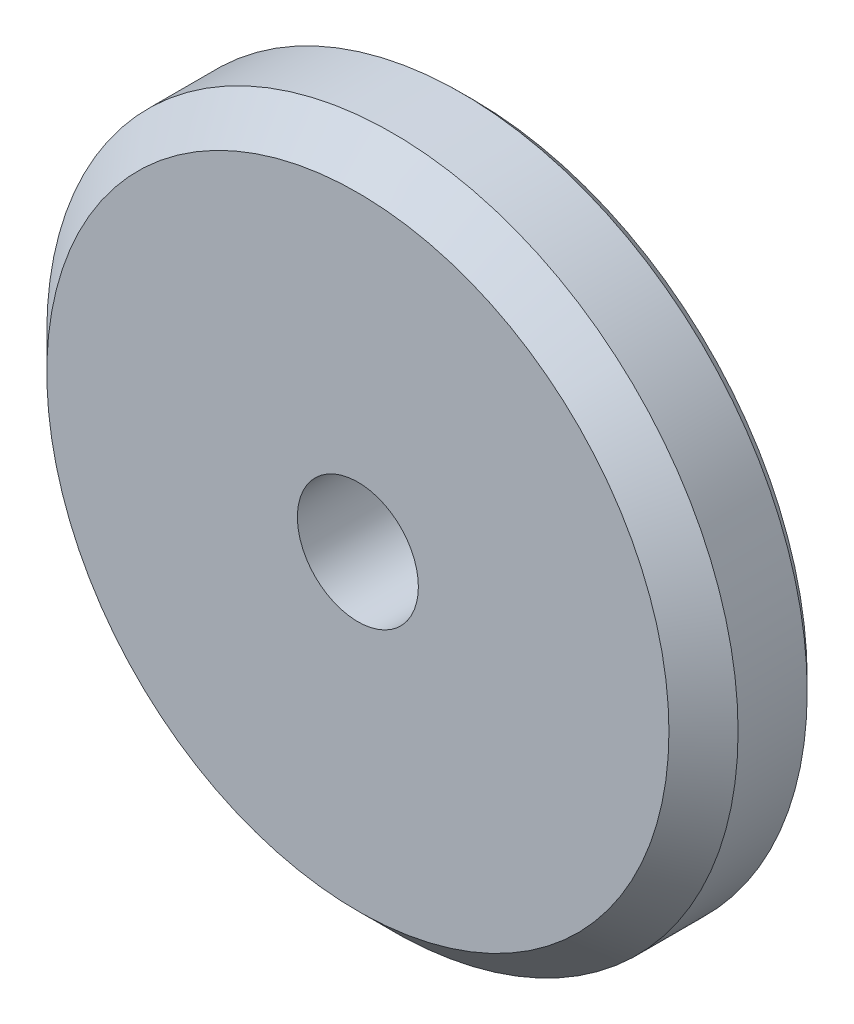
ISO-10303-21;
HEADER;
FILE_DESCRIPTION(('STEP AP214'),'2;1');
FILE_NAME('part.step','',(''),(''),'','','');
FILE_SCHEMA(('AUTOMOTIVE_DESIGN { 1 0 10303 214 1 1 1 1 }'));
ENDSEC;
DATA;
#1=APPLICATION_CONTEXT('core data for automotive mechanical design processes');
#2=APPLICATION_PROTOCOL_DEFINITION('international standard','automotive_design',2000,#1);
#3=PRODUCT_CONTEXT('',#1,'mechanical');
#4=PRODUCT('Part','Part','',(#3));
#5=PRODUCT_RELATED_PRODUCT_CATEGORY('part','',(#4));
#6=PRODUCT_DEFINITION_FORMATION('','',#4);
#7=PRODUCT_DEFINITION_CONTEXT('part definition',#1,'design');
#8=PRODUCT_DEFINITION('design','',#6,#7);
#9=PRODUCT_DEFINITION_SHAPE('','',#8);
#10=(LENGTH_UNIT() NAMED_UNIT(*) SI_UNIT(.MILLI.,.METRE.));
#11=(NAMED_UNIT(*) PLANE_ANGLE_UNIT() SI_UNIT($,.RADIAN.));
#12=(NAMED_UNIT(*) SI_UNIT($,.STERADIAN.) SOLID_ANGLE_UNIT());
#13=UNCERTAINTY_MEASURE_WITH_UNIT(LENGTH_MEASURE(1.E-05),#10,'distance_accuracy_value','');
#14=(GEOMETRIC_REPRESENTATION_CONTEXT(3) GLOBAL_UNCERTAINTY_ASSIGNED_CONTEXT((#13)) GLOBAL_UNIT_ASSIGNED_CONTEXT((#10,
#11,#12)) REPRESENTATION_CONTEXT('',''));
#15=CARTESIAN_POINT('',(0.,0.,0.));
#16=DIRECTION('',(0.,0.,1.));
#17=DIRECTION('',(1.,0.,0.));
#18=AXIS2_PLACEMENT_3D('',#15,#16,#17);
#19=CARTESIAN_POINT('',(0.,0.,10.));
#20=DIRECTION('',(0.,0.,1.));
#21=DIRECTION('',(1.,0.,0.));
#22=AXIS2_PLACEMENT_3D('',#19,#20,#21);
#23=PLANE('',#22);
#24=CARTESIAN_POINT('',(0.,0.,10.));
#25=DIRECTION('',(0.,0.,1.));
#26=DIRECTION('',(1.,0.,0.));
#27=AXIS2_PLACEMENT_3D('',#24,#25,#26);
#28=CIRCLE('',#27,26.9999999999743);
#29=CARTESIAN_POINT('',(26.9999999999743,0.,10.));
#30=VERTEX_POINT('',#29);
#31=EDGE_CURVE('E47',#30,#30,#28,.T.);
#32=ORIENTED_EDGE('',*,*,#31,.T.);
#33=EDGE_LOOP('',(#32));
#34=FACE_BOUND('',#33,.T.);
#35=CARTESIAN_POINT('',(0.,0.,10.));
#36=DIRECTION('',(0.,0.,1.));
#37=DIRECTION('',(1.,0.,0.));
#38=AXIS2_PLACEMENT_3D('',#35,#36,#37);
#39=CIRCLE('',#38,5.25);
#40=CARTESIAN_POINT('',(5.25,0.,10.));
#41=VERTEX_POINT('',#40);
#42=EDGE_CURVE('E52',#41,#41,#39,.T.);
#43=ORIENTED_EDGE('',*,*,#42,.F.);
#44=EDGE_LOOP('',(#43));
#45=FACE_BOUND('',#44,.T.);
#46=ADVANCED_FACE('F32',(#34,#45),#23,.T.);
#47=CARTESIAN_POINT('',(0.,0.,0.));
#48=DIRECTION('',(0.,0.,1.));
#49=DIRECTION('',(1.,0.,0.));
#50=AXIS2_PLACEMENT_3D('',#47,#48,#49);
#51=PLANE('',#50);
#52=CARTESIAN_POINT('',(0.,0.,0.));
#53=DIRECTION('',(0.,0.,1.));
#54=DIRECTION('',(1.,0.,0.));
#55=AXIS2_PLACEMENT_3D('',#52,#53,#54);
#56=CIRCLE('',#55,28.9999999999743);
#57=CARTESIAN_POINT('',(28.9999999999743,0.,0.));
#58=VERTEX_POINT('',#57);
#59=EDGE_CURVE('E10',#58,#58,#56,.F.);
#60=ORIENTED_EDGE('',*,*,#59,.T.);
#61=EDGE_LOOP('',(#60));
#62=FACE_BOUND('',#61,.T.);
#63=CARTESIAN_POINT('',(0.,0.,0.));
#64=DIRECTION('',(0.,0.,1.));
#65=DIRECTION('',(1.,0.,0.));
#66=AXIS2_PLACEMENT_3D('',#63,#64,#65);
#67=CIRCLE('',#66,5.25);
#68=CARTESIAN_POINT('',(5.25,0.,0.));
#69=VERTEX_POINT('',#68);
#70=EDGE_CURVE('E53',#69,#69,#67,.T.);
#71=ORIENTED_EDGE('',*,*,#70,.T.);
#72=EDGE_LOOP('',(#71));
#73=FACE_BOUND('',#72,.T.);
#74=ADVANCED_FACE('F63',(#62,#73),#51,.F.);
#75=CARTESIAN_POINT('',(0.,0.,10.));
#76=DIRECTION('',(0.,0.,-1.));
#77=DIRECTION('',(-1.,0.,0.));
#78=AXIS2_PLACEMENT_3D('',#75,#76,#77);
#79=CYLINDRICAL_SURFACE('',#78,29.9999999999743);
#80=CARTESIAN_POINT('',(0.,0.,1.));
#81=DIRECTION('',(0.,0.,1.));
#82=DIRECTION('',(1.,0.,0.));
#83=AXIS2_PLACEMENT_3D('',#80,#81,#82);
#84=CIRCLE('',#83,29.9999999999743);
#85=CARTESIAN_POINT('',(29.9999999999743,0.,1.));
#86=VERTEX_POINT('',#85);
#87=EDGE_CURVE('E39',#86,#86,#84,.T.);
#88=ORIENTED_EDGE('',*,*,#87,.T.);
#89=EDGE_LOOP('',(#88));
#90=FACE_BOUND('',#89,.T.);
#91=CARTESIAN_POINT('',(0.,0.,6.99999999999998));
#92=DIRECTION('',(0.,0.,1.));
#93=DIRECTION('',(1.,0.,0.));
#94=AXIS2_PLACEMENT_3D('',#91,#92,#93);
#95=CIRCLE('',#94,29.9999999999743);
#96=CARTESIAN_POINT('',(29.9999999999743,0.,6.99999999999998));
#97=VERTEX_POINT('',#96);
#98=EDGE_CURVE('E43',#97,#97,#95,.F.);
#99=ORIENTED_EDGE('',*,*,#98,.T.);
#100=EDGE_LOOP('',(#99));
#101=FACE_BOUND('',#100,.T.);
#102=ADVANCED_FACE('F69',(#90,#101),#79,.T.);
#103=CARTESIAN_POINT('',(0.,0.,10.));
#104=DIRECTION('',(0.,0.,-1.));
#105=DIRECTION('',(-1.,0.,0.));
#106=AXIS2_PLACEMENT_3D('',#103,#104,#105);
#107=CYLINDRICAL_SURFACE('',#106,5.25);
#108=ORIENTED_EDGE('',*,*,#42,.T.);
#109=EDGE_LOOP('',(#108));
#110=FACE_BOUND('',#109,.T.);
#111=ORIENTED_EDGE('',*,*,#70,.F.);
#112=EDGE_LOOP('',(#111));
#113=FACE_BOUND('',#112,.T.);
#114=ADVANCED_FACE('F59',(#110,#113),#107,.F.);
#115=CARTESIAN_POINT('',(0.,0.,10.));
#116=DIRECTION('',(0.,0.,-1.));
#117=DIRECTION('',(-1.,0.,0.));
#118=AXIS2_PLACEMENT_3D('',#115,#116,#117);
#119=CONICAL_SURFACE('',#118,26.9999999999743,0.785398163397445);
#120=ORIENTED_EDGE('',*,*,#98,.F.);
#121=EDGE_LOOP('',(#120));
#122=FACE_BOUND('',#121,.T.);
#123=ORIENTED_EDGE('',*,*,#31,.F.);
#124=EDGE_LOOP('',(#123));
#125=FACE_BOUND('',#124,.T.);
#126=ADVANCED_FACE('F74',(#122,#125),#119,.T.);
#127=CARTESIAN_POINT('',(0.,0.,1.));
#128=DIRECTION('',(0.,0.,1.));
#129=DIRECTION('',(1.,0.,0.));
#130=AXIS2_PLACEMENT_3D('',#127,#128,#129);
#131=CONICAL_SURFACE('',#130,29.9999999999743,0.785398163397448);
#132=ORIENTED_EDGE('',*,*,#59,.F.);
#133=EDGE_LOOP('',(#132));
#134=FACE_BOUND('',#133,.T.);
#135=ORIENTED_EDGE('',*,*,#87,.F.);
#136=EDGE_LOOP('',(#135));
#137=FACE_BOUND('',#136,.T.);
#138=ADVANCED_FACE('F34',(#134,#137),#131,.T.);
#139=CLOSED_SHELL('',(#46,#74,#102,#114,#126,#138));
#140=MANIFOLD_SOLID_BREP('B2',#139);
#141=ADVANCED_BREP_SHAPE_REPRESENTATION('',(#18,#140),#14);
#142=SHAPE_DEFINITION_REPRESENTATION(#9,#141);
ENDSEC;
END-ISO-10303-21;
